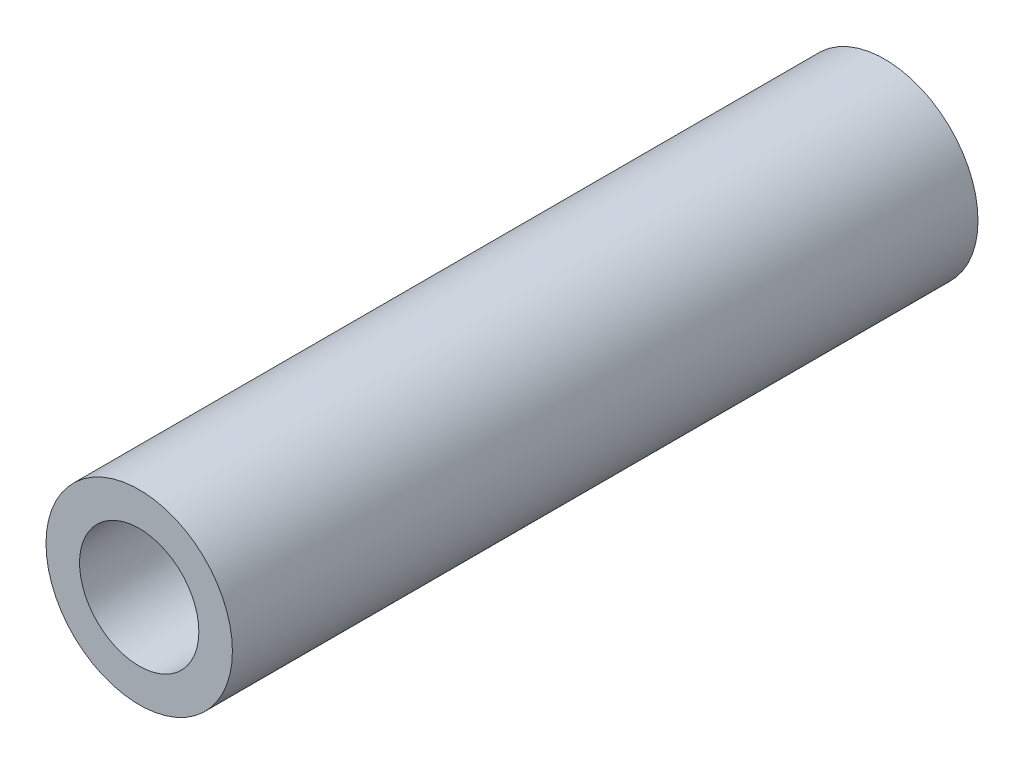
ISO-10303-21;
HEADER;
FILE_DESCRIPTION(('STEP AP214'),'2;1');
FILE_NAME('part.step','',(''),(''),'','','');
FILE_SCHEMA(('AUTOMOTIVE_DESIGN { 1 0 10303 214 1 1 1 1 }'));
ENDSEC;
DATA;
#1=APPLICATION_CONTEXT('core data for automotive mechanical design processes');
#2=APPLICATION_PROTOCOL_DEFINITION('international standard','automotive_design',2000,#1);
#3=PRODUCT_CONTEXT('',#1,'mechanical');
#4=PRODUCT('Part','Part','',(#3));
#5=PRODUCT_RELATED_PRODUCT_CATEGORY('part','',(#4));
#6=PRODUCT_DEFINITION_FORMATION('','',#4);
#7=PRODUCT_DEFINITION_CONTEXT('part definition',#1,'design');
#8=PRODUCT_DEFINITION('design','',#6,#7);
#9=PRODUCT_DEFINITION_SHAPE('','',#8);
#10=(LENGTH_UNIT() NAMED_UNIT(*) SI_UNIT(.MILLI.,.METRE.));
#11=(NAMED_UNIT(*) PLANE_ANGLE_UNIT() SI_UNIT($,.RADIAN.));
#12=(NAMED_UNIT(*) SI_UNIT($,.STERADIAN.) SOLID_ANGLE_UNIT());
#13=UNCERTAINTY_MEASURE_WITH_UNIT(LENGTH_MEASURE(1.E-05),#10,'distance_accuracy_value','');
#14=(GEOMETRIC_REPRESENTATION_CONTEXT(3) GLOBAL_UNCERTAINTY_ASSIGNED_CONTEXT((#13)) GLOBAL_UNIT_ASSIGNED_CONTEXT((#10,
#11,#12)) REPRESENTATION_CONTEXT('',''));
#15=CARTESIAN_POINT('',(0.,0.,0.));
#16=DIRECTION('',(0.,0.,1.));
#17=DIRECTION('',(1.,0.,0.));
#18=AXIS2_PLACEMENT_3D('',#15,#16,#17);
#19=CARTESIAN_POINT('',(0.,0.,20.));
#20=DIRECTION('',(0.,0.,1.));
#21=DIRECTION('',(1.,0.,0.));
#22=AXIS2_PLACEMENT_3D('',#19,#20,#21);
#23=PLANE('',#22);
#24=CARTESIAN_POINT('',(0.,0.,20.));
#25=DIRECTION('',(0.,0.,1.));
#26=DIRECTION('',(1.,0.,0.));
#27=AXIS2_PLACEMENT_3D('',#24,#25,#26);
#28=CIRCLE('',#27,2.5);
#29=CARTESIAN_POINT('',(2.5,0.,20.));
#30=VERTEX_POINT('',#29);
#31=EDGE_CURVE('E10',#30,#30,#28,.T.);
#32=ORIENTED_EDGE('',*,*,#31,.T.);
#33=EDGE_LOOP('',(#32));
#34=FACE_BOUND('',#33,.T.);
#35=CARTESIAN_POINT('',(0.,0.,20.));
#36=DIRECTION('',(0.,0.,1.));
#37=DIRECTION('',(1.,0.,0.));
#38=AXIS2_PLACEMENT_3D('',#35,#36,#37);
#39=CIRCLE('',#38,1.6);
#40=CARTESIAN_POINT('',(1.6,0.,20.));
#41=VERTEX_POINT('',#40);
#42=EDGE_CURVE('E42',#41,#41,#39,.T.);
#43=ORIENTED_EDGE('',*,*,#42,.F.);
#44=EDGE_LOOP('',(#43));
#45=FACE_BOUND('',#44,.T.);
#46=ADVANCED_FACE('F31',(#34,#45),#23,.T.);
#47=CARTESIAN_POINT('',(0.,0.,0.));
#48=DIRECTION('',(0.,0.,1.));
#49=DIRECTION('',(1.,0.,0.));
#50=AXIS2_PLACEMENT_3D('',#47,#48,#49);
#51=PLANE('',#50);
#52=CARTESIAN_POINT('',(0.,0.,0.));
#53=DIRECTION('',(0.,0.,1.));
#54=DIRECTION('',(1.,0.,0.));
#55=AXIS2_PLACEMENT_3D('',#52,#53,#54);
#56=CIRCLE('',#55,2.5);
#57=CARTESIAN_POINT('',(2.5,0.,0.));
#58=VERTEX_POINT('',#57);
#59=EDGE_CURVE('E35',#58,#58,#56,.T.);
#60=ORIENTED_EDGE('',*,*,#59,.F.);
#61=EDGE_LOOP('',(#60));
#62=FACE_BOUND('',#61,.T.);
#63=CARTESIAN_POINT('',(0.,0.,0.));
#64=DIRECTION('',(0.,0.,1.));
#65=DIRECTION('',(1.,0.,0.));
#66=AXIS2_PLACEMENT_3D('',#63,#64,#65);
#67=CIRCLE('',#66,1.6);
#68=CARTESIAN_POINT('',(1.6,0.,0.));
#69=VERTEX_POINT('',#68);
#70=EDGE_CURVE('E44',#69,#69,#67,.T.);
#71=ORIENTED_EDGE('',*,*,#70,.T.);
#72=EDGE_LOOP('',(#71));
#73=FACE_BOUND('',#72,.T.);
#74=ADVANCED_FACE('F54',(#62,#73),#51,.F.);
#75=CARTESIAN_POINT('',(0.,0.,20.));
#76=DIRECTION('',(0.,0.,-1.));
#77=DIRECTION('',(-1.,0.,0.));
#78=AXIS2_PLACEMENT_3D('',#75,#76,#77);
#79=CYLINDRICAL_SURFACE('',#78,2.5);
#80=ORIENTED_EDGE('',*,*,#31,.F.);
#81=EDGE_LOOP('',(#80));
#82=FACE_BOUND('',#81,.T.);
#83=ORIENTED_EDGE('',*,*,#59,.T.);
#84=EDGE_LOOP('',(#83));
#85=FACE_BOUND('',#84,.T.);
#86=ADVANCED_FACE('F33',(#82,#85),#79,.T.);
#87=CARTESIAN_POINT('',(0.,0.,20.));
#88=DIRECTION('',(0.,0.,-1.));
#89=DIRECTION('',(-1.,0.,0.));
#90=AXIS2_PLACEMENT_3D('',#87,#88,#89);
#91=CYLINDRICAL_SURFACE('',#90,1.6);
#92=ORIENTED_EDGE('',*,*,#42,.T.);
#93=EDGE_LOOP('',(#92));
#94=FACE_BOUND('',#93,.T.);
#95=ORIENTED_EDGE('',*,*,#70,.F.);
#96=EDGE_LOOP('',(#95));
#97=FACE_BOUND('',#96,.T.);
#98=ADVANCED_FACE('F50',(#94,#97),#91,.F.);
#99=CLOSED_SHELL('',(#46,#74,#86,#98));
#100=MANIFOLD_SOLID_BREP('B2',#99);
#101=ADVANCED_BREP_SHAPE_REPRESENTATION('',(#18,#100),#14);
#102=SHAPE_DEFINITION_REPRESENTATION(#9,#101);
ENDSEC;
END-ISO-10303-21;
